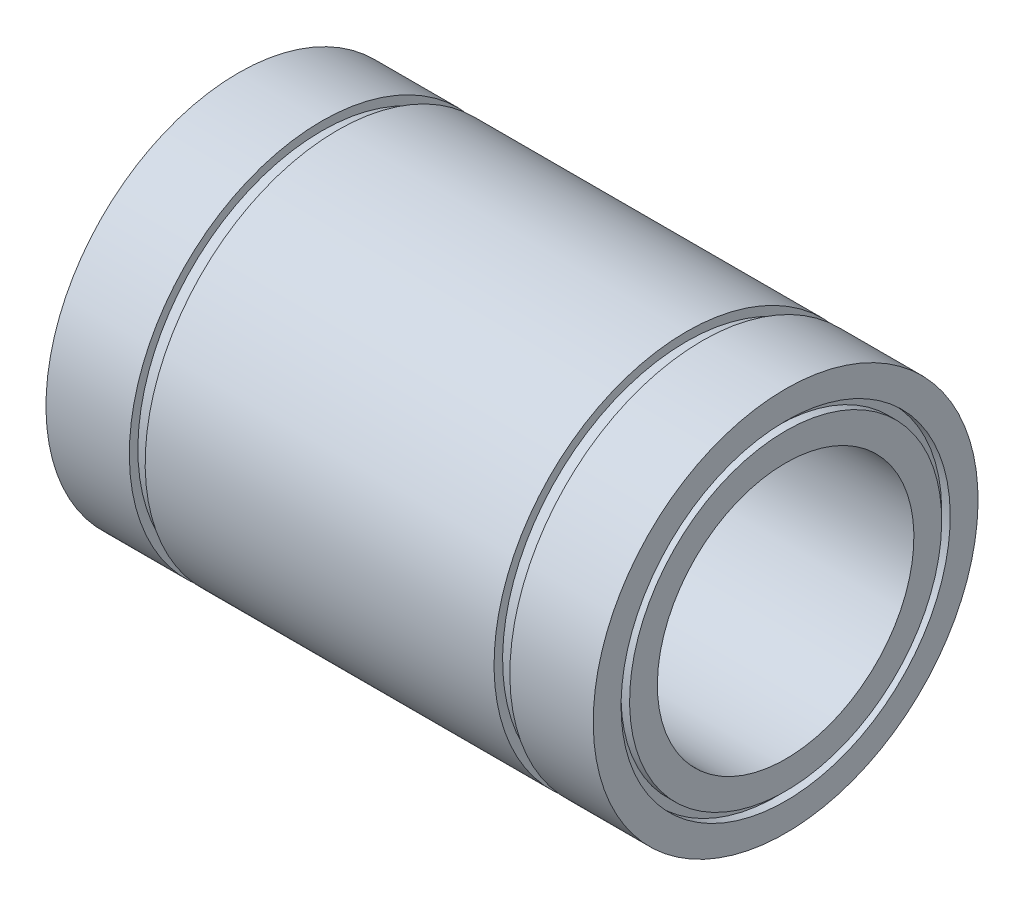
ISO-10303-21;
HEADER;
FILE_DESCRIPTION(('STEP AP214'),'2;1');
FILE_NAME('part.step','',(''),(''),'','','');
FILE_SCHEMA(('AUTOMOTIVE_DESIGN { 1 0 10303 214 1 1 1 1 }'));
ENDSEC;
DATA;
#1=APPLICATION_CONTEXT('core data for automotive mechanical design processes');
#2=APPLICATION_PROTOCOL_DEFINITION('international standard','automotive_design',2000,#1);
#3=PRODUCT_CONTEXT('',#1,'mechanical');
#4=PRODUCT('Part','Part','',(#3));
#5=PRODUCT_RELATED_PRODUCT_CATEGORY('part','',(#4));
#6=PRODUCT_DEFINITION_FORMATION('','',#4);
#7=PRODUCT_DEFINITION_CONTEXT('part definition',#1,'design');
#8=PRODUCT_DEFINITION('design','',#6,#7);
#9=PRODUCT_DEFINITION_SHAPE('','',#8);
#10=(LENGTH_UNIT() NAMED_UNIT(*) SI_UNIT(.MILLI.,.METRE.));
#11=(NAMED_UNIT(*) PLANE_ANGLE_UNIT() SI_UNIT($,.RADIAN.));
#12=(NAMED_UNIT(*) SI_UNIT($,.STERADIAN.) SOLID_ANGLE_UNIT());
#13=UNCERTAINTY_MEASURE_WITH_UNIT(LENGTH_MEASURE(1.E-05),#10,'distance_accuracy_value','');
#14=(GEOMETRIC_REPRESENTATION_CONTEXT(3) GLOBAL_UNCERTAINTY_ASSIGNED_CONTEXT((#13)) GLOBAL_UNIT_ASSIGNED_CONTEXT((#10,
#11,#12)) REPRESENTATION_CONTEXT('',''));
#15=CARTESIAN_POINT('',(0.,0.,0.));
#16=DIRECTION('',(0.,0.,1.));
#17=DIRECTION('',(1.,0.,0.));
#18=AXIS2_PLACEMENT_3D('',#15,#16,#17);
#19=CARTESIAN_POINT('',(-32.,19.25,0.));
#20=DIRECTION('',(-1.,0.,0.));
#21=DIRECTION('',(0.,-1.,0.));
#22=AXIS2_PLACEMENT_3D('',#19,#20,#21);
#23=PLANE('',#22);
#24=CARTESIAN_POINT('',(-32.,0.,0.));
#25=DIRECTION('',(1.,0.,0.));
#26=DIRECTION('',(0.,1.,0.));
#27=AXIS2_PLACEMENT_3D('',#24,#25,#26);
#28=CIRCLE('',#27,19.25);
#29=CARTESIAN_POINT('',(-32.,19.25,0.));
#30=VERTEX_POINT('',#29);
#31=EDGE_CURVE('E100',#30,#30,#28,.T.);
#32=ORIENTED_EDGE('',*,*,#31,.T.);
#33=EDGE_LOOP('',(#32));
#34=FACE_BOUND('',#33,.T.);
#35=CARTESIAN_POINT('',(-32.,0.,0.));
#36=DIRECTION('',(1.,0.,0.));
#37=DIRECTION('',(0.,1.,0.));
#38=AXIS2_PLACEMENT_3D('',#35,#36,#37);
#39=CIRCLE('',#38,22.5);
#40=CARTESIAN_POINT('',(-32.,22.5,0.));
#41=VERTEX_POINT('',#40);
#42=EDGE_CURVE('E10',#41,#41,#39,.T.);
#43=ORIENTED_EDGE('',*,*,#42,.F.);
#44=EDGE_LOOP('',(#43));
#45=FACE_BOUND('',#44,.T.);
#46=ADVANCED_FACE('F36',(#34,#45),#23,.T.);
#47=CARTESIAN_POINT('',(0.,0.,0.));
#48=DIRECTION('',(1.,0.,0.));
#49=DIRECTION('',(0.,1.,0.));
#50=AXIS2_PLACEMENT_3D('',#47,#48,#49);
#51=CYLINDRICAL_SURFACE('',#50,22.5);
#52=ORIENTED_EDGE('',*,*,#42,.T.);
#53=EDGE_LOOP('',(#52));
#54=FACE_BOUND('',#53,.T.);
#55=CARTESIAN_POINT('',(-22.25,0.,0.));
#56=DIRECTION('',(1.,0.,0.));
#57=DIRECTION('',(0.,1.,0.));
#58=AXIS2_PLACEMENT_3D('',#55,#56,#57);
#59=CIRCLE('',#58,22.5);
#60=CARTESIAN_POINT('',(-22.25,22.5,0.));
#61=VERTEX_POINT('',#60);
#62=EDGE_CURVE('E42',#61,#61,#59,.T.);
#63=ORIENTED_EDGE('',*,*,#62,.F.);
#64=EDGE_LOOP('',(#63));
#65=FACE_BOUND('',#64,.T.);
#66=ADVANCED_FACE('F118',(#54,#65),#51,.T.);
#67=CARTESIAN_POINT('',(-22.25,22.5,0.));
#68=DIRECTION('',(1.,0.,0.));
#69=DIRECTION('',(0.,1.,0.));
#70=AXIS2_PLACEMENT_3D('',#67,#68,#69);
#71=PLANE('',#70);
#72=ORIENTED_EDGE('',*,*,#62,.T.);
#73=EDGE_LOOP('',(#72));
#74=FACE_BOUND('',#73,.T.);
#75=CARTESIAN_POINT('',(-22.25,0.,0.));
#76=DIRECTION('',(1.,0.,0.));
#77=DIRECTION('',(0.,1.,0.));
#78=AXIS2_PLACEMENT_3D('',#75,#76,#77);
#79=CIRCLE('',#78,21.5);
#80=CARTESIAN_POINT('',(-22.25,21.5,0.));
#81=VERTEX_POINT('',#80);
#82=EDGE_CURVE('E46',#81,#81,#79,.T.);
#83=ORIENTED_EDGE('',*,*,#82,.F.);
#84=EDGE_LOOP('',(#83));
#85=FACE_BOUND('',#84,.T.);
#86=ADVANCED_FACE('F122',(#74,#85),#71,.T.);
#87=CARTESIAN_POINT('',(0.,0.,0.));
#88=DIRECTION('',(1.,0.,0.));
#89=DIRECTION('',(0.,1.,0.));
#90=AXIS2_PLACEMENT_3D('',#87,#88,#89);
#91=CYLINDRICAL_SURFACE('',#90,21.5);
#92=ORIENTED_EDGE('',*,*,#82,.T.);
#93=EDGE_LOOP('',(#92));
#94=FACE_BOUND('',#93,.T.);
#95=CARTESIAN_POINT('',(-20.4,0.,0.));
#96=DIRECTION('',(1.,0.,0.));
#97=DIRECTION('',(0.,1.,0.));
#98=AXIS2_PLACEMENT_3D('',#95,#96,#97);
#99=CIRCLE('',#98,21.5);
#100=CARTESIAN_POINT('',(-20.4,21.5,0.));
#101=VERTEX_POINT('',#100);
#102=EDGE_CURVE('E50',#101,#101,#99,.T.);
#103=ORIENTED_EDGE('',*,*,#102,.F.);
#104=EDGE_LOOP('',(#103));
#105=FACE_BOUND('',#104,.T.);
#106=ADVANCED_FACE('F126',(#94,#105),#91,.T.);
#107=CARTESIAN_POINT('',(-20.4,21.5,0.));
#108=DIRECTION('',(-1.,0.,0.));
#109=DIRECTION('',(0.,-1.,0.));
#110=AXIS2_PLACEMENT_3D('',#107,#108,#109);
#111=PLANE('',#110);
#112=ORIENTED_EDGE('',*,*,#102,.T.);
#113=EDGE_LOOP('',(#112));
#114=FACE_BOUND('',#113,.T.);
#115=CARTESIAN_POINT('',(-20.4,0.,0.));
#116=DIRECTION('',(1.,0.,0.));
#117=DIRECTION('',(0.,1.,0.));
#118=AXIS2_PLACEMENT_3D('',#115,#116,#117);
#119=CIRCLE('',#118,22.5);
#120=CARTESIAN_POINT('',(-20.4,22.5,0.));
#121=VERTEX_POINT('',#120);
#122=EDGE_CURVE('E55',#121,#121,#119,.T.);
#123=ORIENTED_EDGE('',*,*,#122,.F.);
#124=EDGE_LOOP('',(#123));
#125=FACE_BOUND('',#124,.T.);
#126=ADVANCED_FACE('F132',(#114,#125),#111,.T.);
#127=CARTESIAN_POINT('',(0.,0.,0.));
#128=DIRECTION('',(1.,0.,0.));
#129=DIRECTION('',(0.,1.,0.));
#130=AXIS2_PLACEMENT_3D('',#127,#128,#129);
#131=CYLINDRICAL_SURFACE('',#130,22.5);
#132=ORIENTED_EDGE('',*,*,#122,.T.);
#133=EDGE_LOOP('',(#132));
#134=FACE_BOUND('',#133,.T.);
#135=CARTESIAN_POINT('',(20.4,0.,0.));
#136=DIRECTION('',(1.,0.,0.));
#137=DIRECTION('',(0.,1.,0.));
#138=AXIS2_PLACEMENT_3D('',#135,#136,#137);
#139=CIRCLE('',#138,22.5);
#140=CARTESIAN_POINT('',(20.4,22.5,0.));
#141=VERTEX_POINT('',#140);
#142=EDGE_CURVE('E58',#141,#141,#139,.T.);
#143=ORIENTED_EDGE('',*,*,#142,.F.);
#144=EDGE_LOOP('',(#143));
#145=FACE_BOUND('',#144,.T.);
#146=ADVANCED_FACE('F136',(#134,#145),#131,.T.);
#147=CARTESIAN_POINT('',(20.4,22.5,0.));
#148=DIRECTION('',(1.,0.,0.));
#149=DIRECTION('',(0.,1.,0.));
#150=AXIS2_PLACEMENT_3D('',#147,#148,#149);
#151=PLANE('',#150);
#152=ORIENTED_EDGE('',*,*,#142,.T.);
#153=EDGE_LOOP('',(#152));
#154=FACE_BOUND('',#153,.T.);
#155=CARTESIAN_POINT('',(20.4,0.,0.));
#156=DIRECTION('',(1.,0.,0.));
#157=DIRECTION('',(0.,1.,0.));
#158=AXIS2_PLACEMENT_3D('',#155,#156,#157);
#159=CIRCLE('',#158,21.5);
#160=CARTESIAN_POINT('',(20.4,21.5,0.));
#161=VERTEX_POINT('',#160);
#162=EDGE_CURVE('E61',#161,#161,#159,.T.);
#163=ORIENTED_EDGE('',*,*,#162,.F.);
#164=EDGE_LOOP('',(#163));
#165=FACE_BOUND('',#164,.T.);
#166=ADVANCED_FACE('F140',(#154,#165),#151,.T.);
#167=CARTESIAN_POINT('',(0.,0.,0.));
#168=DIRECTION('',(1.,0.,0.));
#169=DIRECTION('',(0.,1.,0.));
#170=AXIS2_PLACEMENT_3D('',#167,#168,#169);
#171=CYLINDRICAL_SURFACE('',#170,21.5);
#172=ORIENTED_EDGE('',*,*,#162,.T.);
#173=EDGE_LOOP('',(#172));
#174=FACE_BOUND('',#173,.T.);
#175=CARTESIAN_POINT('',(22.25,0.,0.));
#176=DIRECTION('',(1.,0.,0.));
#177=DIRECTION('',(0.,1.,0.));
#178=AXIS2_PLACEMENT_3D('',#175,#176,#177);
#179=CIRCLE('',#178,21.5);
#180=CARTESIAN_POINT('',(22.25,21.5,0.));
#181=VERTEX_POINT('',#180);
#182=EDGE_CURVE('E64',#181,#181,#179,.T.);
#183=ORIENTED_EDGE('',*,*,#182,.F.);
#184=EDGE_LOOP('',(#183));
#185=FACE_BOUND('',#184,.T.);
#186=ADVANCED_FACE('F144',(#174,#185),#171,.T.);
#187=CARTESIAN_POINT('',(22.25,21.5,0.));
#188=DIRECTION('',(-1.,0.,0.));
#189=DIRECTION('',(0.,-1.,0.));
#190=AXIS2_PLACEMENT_3D('',#187,#188,#189);
#191=PLANE('',#190);
#192=ORIENTED_EDGE('',*,*,#182,.T.);
#193=EDGE_LOOP('',(#192));
#194=FACE_BOUND('',#193,.T.);
#195=CARTESIAN_POINT('',(22.25,0.,0.));
#196=DIRECTION('',(1.,0.,0.));
#197=DIRECTION('',(0.,1.,0.));
#198=AXIS2_PLACEMENT_3D('',#195,#196,#197);
#199=CIRCLE('',#198,22.5);
#200=CARTESIAN_POINT('',(22.25,22.5,0.));
#201=VERTEX_POINT('',#200);
#202=EDGE_CURVE('E67',#201,#201,#199,.T.);
#203=ORIENTED_EDGE('',*,*,#202,.F.);
#204=EDGE_LOOP('',(#203));
#205=FACE_BOUND('',#204,.T.);
#206=ADVANCED_FACE('F148',(#194,#205),#191,.T.);
#207=CARTESIAN_POINT('',(0.,0.,0.));
#208=DIRECTION('',(1.,0.,0.));
#209=DIRECTION('',(0.,1.,0.));
#210=AXIS2_PLACEMENT_3D('',#207,#208,#209);
#211=CYLINDRICAL_SURFACE('',#210,22.5);
#212=ORIENTED_EDGE('',*,*,#202,.T.);
#213=EDGE_LOOP('',(#212));
#214=FACE_BOUND('',#213,.T.);
#215=CARTESIAN_POINT('',(32.,0.,0.));
#216=DIRECTION('',(1.,0.,0.));
#217=DIRECTION('',(0.,1.,0.));
#218=AXIS2_PLACEMENT_3D('',#215,#216,#217);
#219=CIRCLE('',#218,22.4999999999999);
#220=CARTESIAN_POINT('',(32.,22.4999999999999,0.));
#221=VERTEX_POINT('',#220);
#222=EDGE_CURVE('E70',#221,#221,#219,.T.);
#223=ORIENTED_EDGE('',*,*,#222,.F.);
#224=EDGE_LOOP('',(#223));
#225=FACE_BOUND('',#224,.T.);
#226=ADVANCED_FACE('F152',(#214,#225),#211,.T.);
#227=CARTESIAN_POINT('',(32.,22.4999999999999,0.));
#228=DIRECTION('',(1.,0.,0.));
#229=DIRECTION('',(0.,1.,0.));
#230=AXIS2_PLACEMENT_3D('',#227,#228,#229);
#231=PLANE('',#230);
#232=ORIENTED_EDGE('',*,*,#222,.T.);
#233=EDGE_LOOP('',(#232));
#234=FACE_BOUND('',#233,.T.);
#235=CARTESIAN_POINT('',(32.,0.,0.));
#236=DIRECTION('',(1.,0.,0.));
#237=DIRECTION('',(0.,1.,0.));
#238=AXIS2_PLACEMENT_3D('',#235,#236,#237);
#239=CIRCLE('',#238,19.25);
#240=CARTESIAN_POINT('',(32.,19.25,0.));
#241=VERTEX_POINT('',#240);
#242=EDGE_CURVE('E73',#241,#241,#239,.T.);
#243=ORIENTED_EDGE('',*,*,#242,.F.);
#244=EDGE_LOOP('',(#243));
#245=FACE_BOUND('',#244,.T.);
#246=ADVANCED_FACE('F156',(#234,#245),#231,.T.);
#247=CARTESIAN_POINT('',(0.,0.,0.));
#248=DIRECTION('',(1.,0.,0.));
#249=DIRECTION('',(0.,1.,0.));
#250=AXIS2_PLACEMENT_3D('',#247,#248,#249);
#251=CYLINDRICAL_SURFACE('',#250,19.25);
#252=ORIENTED_EDGE('',*,*,#242,.T.);
#253=EDGE_LOOP('',(#252));
#254=FACE_BOUND('',#253,.T.);
#255=CARTESIAN_POINT('',(31.,0.,0.));
#256=DIRECTION('',(1.,0.,0.));
#257=DIRECTION('',(0.,1.,0.));
#258=AXIS2_PLACEMENT_3D('',#255,#256,#257);
#259=CIRCLE('',#258,19.25);
#260=CARTESIAN_POINT('',(31.,19.25,0.));
#261=VERTEX_POINT('',#260);
#262=EDGE_CURVE('E76',#261,#261,#259,.T.);
#263=ORIENTED_EDGE('',*,*,#262,.F.);
#264=EDGE_LOOP('',(#263));
#265=FACE_BOUND('',#264,.T.);
#266=ADVANCED_FACE('F160',(#254,#265),#251,.F.);
#267=CARTESIAN_POINT('',(31.,19.25,0.));
#268=DIRECTION('',(1.,0.,0.));
#269=DIRECTION('',(0.,1.,0.));
#270=AXIS2_PLACEMENT_3D('',#267,#268,#269);
#271=PLANE('',#270);
#272=ORIENTED_EDGE('',*,*,#262,.T.);
#273=EDGE_LOOP('',(#272));
#274=FACE_BOUND('',#273,.T.);
#275=CARTESIAN_POINT('',(31.,0.,0.));
#276=DIRECTION('',(1.,0.,0.));
#277=DIRECTION('',(0.,1.,0.));
#278=AXIS2_PLACEMENT_3D('',#275,#276,#277);
#279=CIRCLE('',#278,18.25);
#280=CARTESIAN_POINT('',(31.,18.25,0.));
#281=VERTEX_POINT('',#280);
#282=EDGE_CURVE('E79',#281,#281,#279,.T.);
#283=ORIENTED_EDGE('',*,*,#282,.F.);
#284=EDGE_LOOP('',(#283));
#285=FACE_BOUND('',#284,.T.);
#286=ADVANCED_FACE('F164',(#274,#285),#271,.T.);
#287=CARTESIAN_POINT('',(0.,0.,0.));
#288=DIRECTION('',(1.,0.,0.));
#289=DIRECTION('',(0.,1.,0.));
#290=AXIS2_PLACEMENT_3D('',#287,#288,#289);
#291=CYLINDRICAL_SURFACE('',#290,18.25);
#292=ORIENTED_EDGE('',*,*,#282,.T.);
#293=EDGE_LOOP('',(#292));
#294=FACE_BOUND('',#293,.T.);
#295=CARTESIAN_POINT('',(32.,0.,0.));
#296=DIRECTION('',(1.,0.,0.));
#297=DIRECTION('',(0.,1.,0.));
#298=AXIS2_PLACEMENT_3D('',#295,#296,#297);
#299=CIRCLE('',#298,18.25);
#300=CARTESIAN_POINT('',(32.,18.25,0.));
#301=VERTEX_POINT('',#300);
#302=EDGE_CURVE('E82',#301,#301,#299,.T.);
#303=ORIENTED_EDGE('',*,*,#302,.F.);
#304=EDGE_LOOP('',(#303));
#305=FACE_BOUND('',#304,.T.);
#306=ADVANCED_FACE('F168',(#294,#305),#291,.T.);
#307=CARTESIAN_POINT('',(32.,18.25,0.));
#308=DIRECTION('',(1.,0.,0.));
#309=DIRECTION('',(0.,1.,0.));
#310=AXIS2_PLACEMENT_3D('',#307,#308,#309);
#311=PLANE('',#310);
#312=ORIENTED_EDGE('',*,*,#302,.T.);
#313=EDGE_LOOP('',(#312));
#314=FACE_BOUND('',#313,.T.);
#315=CARTESIAN_POINT('',(32.,0.,0.));
#316=DIRECTION('',(1.,0.,0.));
#317=DIRECTION('',(0.,1.,0.));
#318=AXIS2_PLACEMENT_3D('',#315,#316,#317);
#319=CIRCLE('',#318,15.);
#320=CARTESIAN_POINT('',(32.,15.,0.));
#321=VERTEX_POINT('',#320);
#322=EDGE_CURVE('E85',#321,#321,#319,.T.);
#323=ORIENTED_EDGE('',*,*,#322,.F.);
#324=EDGE_LOOP('',(#323));
#325=FACE_BOUND('',#324,.T.);
#326=ADVANCED_FACE('F172',(#314,#325),#311,.T.);
#327=CARTESIAN_POINT('',(0.,0.,0.));
#328=DIRECTION('',(1.,0.,0.));
#329=DIRECTION('',(0.,1.,0.));
#330=AXIS2_PLACEMENT_3D('',#327,#328,#329);
#331=CYLINDRICAL_SURFACE('',#330,15.);
#332=ORIENTED_EDGE('',*,*,#322,.T.);
#333=EDGE_LOOP('',(#332));
#334=FACE_BOUND('',#333,.T.);
#335=CARTESIAN_POINT('',(-32.,0.,0.));
#336=DIRECTION('',(1.,0.,0.));
#337=DIRECTION('',(0.,1.,0.));
#338=AXIS2_PLACEMENT_3D('',#335,#336,#337);
#339=CIRCLE('',#338,15.);
#340=CARTESIAN_POINT('',(-32.,15.,0.));
#341=VERTEX_POINT('',#340);
#342=EDGE_CURVE('E88',#341,#341,#339,.T.);
#343=ORIENTED_EDGE('',*,*,#342,.F.);
#344=EDGE_LOOP('',(#343));
#345=FACE_BOUND('',#344,.T.);
#346=ADVANCED_FACE('F176',(#334,#345),#331,.F.);
#347=CARTESIAN_POINT('',(-32.,15.,0.));
#348=DIRECTION('',(-1.,0.,0.));
#349=DIRECTION('',(0.,-1.,0.));
#350=AXIS2_PLACEMENT_3D('',#347,#348,#349);
#351=PLANE('',#350);
#352=ORIENTED_EDGE('',*,*,#342,.T.);
#353=EDGE_LOOP('',(#352));
#354=FACE_BOUND('',#353,.T.);
#355=CARTESIAN_POINT('',(-32.,0.,0.));
#356=DIRECTION('',(1.,0.,0.));
#357=DIRECTION('',(0.,1.,0.));
#358=AXIS2_PLACEMENT_3D('',#355,#356,#357);
#359=CIRCLE('',#358,18.25);
#360=CARTESIAN_POINT('',(-32.,18.25,0.));
#361=VERTEX_POINT('',#360);
#362=EDGE_CURVE('E91',#361,#361,#359,.T.);
#363=ORIENTED_EDGE('',*,*,#362,.F.);
#364=EDGE_LOOP('',(#363));
#365=FACE_BOUND('',#364,.T.);
#366=ADVANCED_FACE('F180',(#354,#365),#351,.T.);
#367=CARTESIAN_POINT('',(0.,0.,0.));
#368=DIRECTION('',(1.,0.,0.));
#369=DIRECTION('',(0.,1.,0.));
#370=AXIS2_PLACEMENT_3D('',#367,#368,#369);
#371=CYLINDRICAL_SURFACE('',#370,18.25);
#372=ORIENTED_EDGE('',*,*,#362,.T.);
#373=EDGE_LOOP('',(#372));
#374=FACE_BOUND('',#373,.T.);
#375=CARTESIAN_POINT('',(-31.,0.,0.));
#376=DIRECTION('',(1.,0.,0.));
#377=DIRECTION('',(0.,1.,0.));
#378=AXIS2_PLACEMENT_3D('',#375,#376,#377);
#379=CIRCLE('',#378,18.25);
#380=CARTESIAN_POINT('',(-31.,18.25,0.));
#381=VERTEX_POINT('',#380);
#382=EDGE_CURVE('E94',#381,#381,#379,.T.);
#383=ORIENTED_EDGE('',*,*,#382,.F.);
#384=EDGE_LOOP('',(#383));
#385=FACE_BOUND('',#384,.T.);
#386=ADVANCED_FACE('F114',(#374,#385),#371,.T.);
#387=CARTESIAN_POINT('',(-31.,19.25,0.));
#388=DIRECTION('',(-1.,0.,0.));
#389=DIRECTION('',(0.,-1.,0.));
#390=AXIS2_PLACEMENT_3D('',#387,#388,#389);
#391=PLANE('',#390);
#392=ORIENTED_EDGE('',*,*,#382,.T.);
#393=EDGE_LOOP('',(#392));
#394=FACE_BOUND('',#393,.T.);
#395=CARTESIAN_POINT('',(-31.,0.,0.));
#396=DIRECTION('',(1.,0.,0.));
#397=DIRECTION('',(0.,1.,0.));
#398=AXIS2_PLACEMENT_3D('',#395,#396,#397);
#399=CIRCLE('',#398,19.25);
#400=CARTESIAN_POINT('',(-31.,19.25,0.));
#401=VERTEX_POINT('',#400);
#402=EDGE_CURVE('E97',#401,#401,#399,.T.);
#403=ORIENTED_EDGE('',*,*,#402,.F.);
#404=EDGE_LOOP('',(#403));
#405=FACE_BOUND('',#404,.T.);
#406=ADVANCED_FACE('F108',(#394,#405),#391,.T.);
#407=CARTESIAN_POINT('',(0.,0.,0.));
#408=DIRECTION('',(1.,0.,0.));
#409=DIRECTION('',(0.,1.,0.));
#410=AXIS2_PLACEMENT_3D('',#407,#408,#409);
#411=CYLINDRICAL_SURFACE('',#410,19.25);
#412=ORIENTED_EDGE('',*,*,#402,.T.);
#413=EDGE_LOOP('',(#412));
#414=FACE_BOUND('',#413,.T.);
#415=ORIENTED_EDGE('',*,*,#31,.F.);
#416=EDGE_LOOP('',(#415));
#417=FACE_BOUND('',#416,.T.);
#418=ADVANCED_FACE('F106',(#414,#417),#411,.F.);
#419=CLOSED_SHELL('',(#46,#66,#86,#106,#126,#146,#166,#186,#206,#226,#246,#266,#286,#306,#326,
#346,#366,#386,#406,#418));
#420=MANIFOLD_SOLID_BREP('B2',#419);
#421=ADVANCED_BREP_SHAPE_REPRESENTATION('',(#18,#420),#14);
#422=SHAPE_DEFINITION_REPRESENTATION(#9,#421);
ENDSEC;
END-ISO-10303-21;
